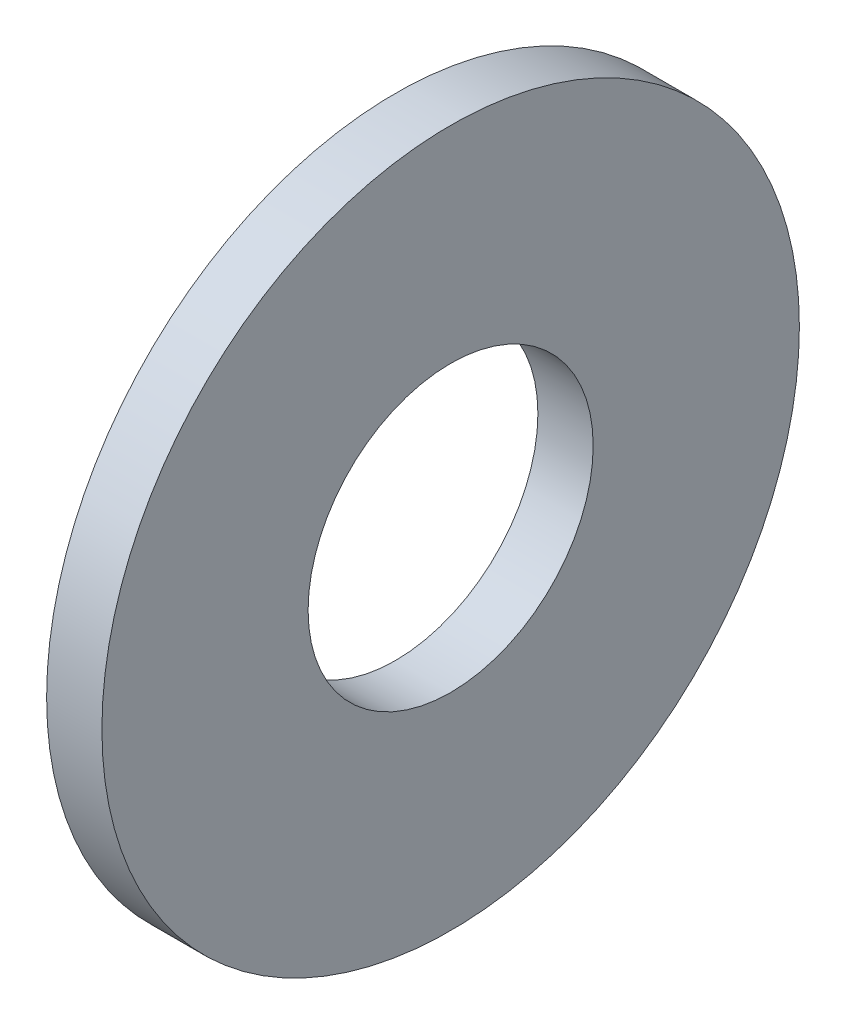
ISO-10303-21;
HEADER;
FILE_DESCRIPTION(('STEP AP214'),'2;1');
FILE_NAME('part.step','',(''),(''),'','','');
FILE_SCHEMA(('AUTOMOTIVE_DESIGN { 1 0 10303 214 1 1 1 1 }'));
ENDSEC;
DATA;
#1=APPLICATION_CONTEXT('core data for automotive mechanical design processes');
#2=APPLICATION_PROTOCOL_DEFINITION('international standard','automotive_design',2000,#1);
#3=PRODUCT_CONTEXT('',#1,'mechanical');
#4=PRODUCT('Part','Part','',(#3));
#5=PRODUCT_RELATED_PRODUCT_CATEGORY('part','',(#4));
#6=PRODUCT_DEFINITION_FORMATION('','',#4);
#7=PRODUCT_DEFINITION_CONTEXT('part definition',#1,'design');
#8=PRODUCT_DEFINITION('design','',#6,#7);
#9=PRODUCT_DEFINITION_SHAPE('','',#8);
#10=(LENGTH_UNIT() NAMED_UNIT(*) SI_UNIT(.MILLI.,.METRE.));
#11=(NAMED_UNIT(*) PLANE_ANGLE_UNIT() SI_UNIT($,.RADIAN.));
#12=(NAMED_UNIT(*) SI_UNIT($,.STERADIAN.) SOLID_ANGLE_UNIT());
#13=UNCERTAINTY_MEASURE_WITH_UNIT(LENGTH_MEASURE(1.E-05),#10,'distance_accuracy_value','');
#14=(GEOMETRIC_REPRESENTATION_CONTEXT(3) GLOBAL_UNCERTAINTY_ASSIGNED_CONTEXT((#13)) GLOBAL_UNIT_ASSIGNED_CONTEXT((#10,
#11,#12)) REPRESENTATION_CONTEXT('',''));
#15=CARTESIAN_POINT('',(0.,0.,0.));
#16=DIRECTION('',(0.,0.,1.));
#17=DIRECTION('',(1.,0.,0.));
#18=AXIS2_PLACEMENT_3D('',#15,#16,#17);
#19=CARTESIAN_POINT('',(-34.925,0.,0.));
#20=DIRECTION('',(-1.,0.,0.));
#21=DIRECTION('',(0.,0.,1.));
#22=AXIS2_PLACEMENT_3D('',#19,#20,#21);
#23=CYLINDRICAL_SURFACE('',#22,7.1374);
#24=CARTESIAN_POINT('',(0.,0.,0.));
#25=DIRECTION('',(-1.,0.,0.));
#26=DIRECTION('',(0.,0.,1.));
#27=AXIS2_PLACEMENT_3D('',#24,#25,#26);
#28=CIRCLE('',#27,7.1374);
#29=CARTESIAN_POINT('',(0.,0.,7.1374));
#30=VERTEX_POINT('',#29);
#31=EDGE_CURVE('E10',#30,#30,#28,.T.);
#32=ORIENTED_EDGE('',*,*,#31,.F.);
#33=EDGE_LOOP('',(#32));
#34=FACE_BOUND('',#33,.T.);
#35=CARTESIAN_POINT('',(-2.7686,0.,0.));
#36=DIRECTION('',(-1.,0.,0.));
#37=DIRECTION('',(0.,0.,1.));
#38=AXIS2_PLACEMENT_3D('',#35,#36,#37);
#39=CIRCLE('',#38,7.1374);
#40=CARTESIAN_POINT('',(-2.7686,0.,7.1374));
#41=VERTEX_POINT('',#40);
#42=EDGE_CURVE('E29',#41,#41,#39,.T.);
#43=ORIENTED_EDGE('',*,*,#42,.T.);
#44=EDGE_LOOP('',(#43));
#45=FACE_BOUND('',#44,.T.);
#46=ADVANCED_FACE('F15',(#34,#45),#23,.F.);
#47=CARTESIAN_POINT('',(0.,7.1374,0.));
#48=DIRECTION('',(-1.,0.,0.));
#49=DIRECTION('',(0.,0.,1.));
#50=AXIS2_PLACEMENT_3D('',#47,#48,#49);
#51=PLANE('',#50);
#52=CARTESIAN_POINT('',(0.,0.,0.));
#53=DIRECTION('',(-1.,0.,0.));
#54=DIRECTION('',(0.,0.,1.));
#55=AXIS2_PLACEMENT_3D('',#52,#53,#54);
#56=CIRCLE('',#55,17.4625);
#57=CARTESIAN_POINT('',(0.,0.,17.4625));
#58=VERTEX_POINT('',#57);
#59=EDGE_CURVE('E21',#58,#58,#56,.T.);
#60=ORIENTED_EDGE('',*,*,#59,.F.);
#61=EDGE_LOOP('',(#60));
#62=FACE_BOUND('',#61,.T.);
#63=ORIENTED_EDGE('',*,*,#31,.T.);
#64=EDGE_LOOP('',(#63));
#65=FACE_BOUND('',#64,.T.);
#66=ADVANCED_FACE('F44',(#62,#65),#51,.F.);
#67=CARTESIAN_POINT('',(-34.925,0.,0.));
#68=DIRECTION('',(-1.,0.,0.));
#69=DIRECTION('',(0.,0.,1.));
#70=AXIS2_PLACEMENT_3D('',#67,#68,#69);
#71=CYLINDRICAL_SURFACE('',#70,17.4625);
#72=CARTESIAN_POINT('',(-2.7686,0.,0.));
#73=DIRECTION('',(-1.,0.,0.));
#74=DIRECTION('',(0.,0.,1.));
#75=AXIS2_PLACEMENT_3D('',#72,#73,#74);
#76=CIRCLE('',#75,17.4625);
#77=CARTESIAN_POINT('',(-2.7686,0.,17.4625));
#78=VERTEX_POINT('',#77);
#79=EDGE_CURVE('E25',#78,#78,#76,.T.);
#80=ORIENTED_EDGE('',*,*,#79,.F.);
#81=EDGE_LOOP('',(#80));
#82=FACE_BOUND('',#81,.T.);
#83=ORIENTED_EDGE('',*,*,#59,.T.);
#84=EDGE_LOOP('',(#83));
#85=FACE_BOUND('',#84,.T.);
#86=ADVANCED_FACE('F39',(#82,#85),#71,.T.);
#87=CARTESIAN_POINT('',(-2.7686,17.4625,0.));
#88=DIRECTION('',(1.,0.,0.));
#89=DIRECTION('',(0.,0.,-1.));
#90=AXIS2_PLACEMENT_3D('',#87,#88,#89);
#91=PLANE('',#90);
#92=ORIENTED_EDGE('',*,*,#42,.F.);
#93=EDGE_LOOP('',(#92));
#94=FACE_BOUND('',#93,.T.);
#95=ORIENTED_EDGE('',*,*,#79,.T.);
#96=EDGE_LOOP('',(#95));
#97=FACE_BOUND('',#96,.T.);
#98=ADVANCED_FACE('F36',(#94,#97),#91,.F.);
#99=CLOSED_SHELL('',(#46,#66,#86,#98));
#100=MANIFOLD_SOLID_BREP('B1',#99);
#101=ADVANCED_BREP_SHAPE_REPRESENTATION('',(#18,#100),#14);
#102=SHAPE_DEFINITION_REPRESENTATION(#9,#101);
ENDSEC;
END-ISO-10303-21;
